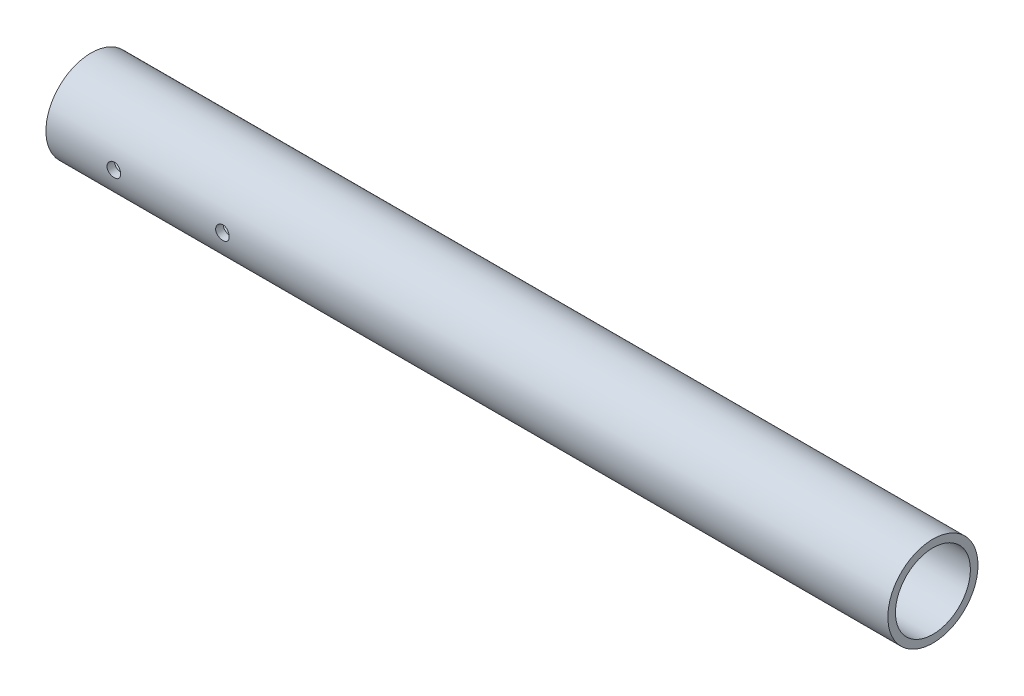
ISO-10303-21;
HEADER;
FILE_DESCRIPTION(('STEP AP214'),'2;1');
FILE_NAME('part.step','',(''),(''),'','','');
FILE_SCHEMA(('AUTOMOTIVE_DESIGN { 1 0 10303 214 1 1 1 1 }'));
ENDSEC;
DATA;
#1=APPLICATION_CONTEXT('core data for automotive mechanical design processes');
#2=APPLICATION_PROTOCOL_DEFINITION('international standard','automotive_design',2000,#1);
#3=PRODUCT_CONTEXT('',#1,'mechanical');
#4=PRODUCT('Part','Part','',(#3));
#5=PRODUCT_RELATED_PRODUCT_CATEGORY('part','',(#4));
#6=PRODUCT_DEFINITION_FORMATION('','',#4);
#7=PRODUCT_DEFINITION_CONTEXT('part definition',#1,'design');
#8=PRODUCT_DEFINITION('design','',#6,#7);
#9=PRODUCT_DEFINITION_SHAPE('','',#8);
#10=(LENGTH_UNIT() NAMED_UNIT(*) SI_UNIT(.MILLI.,.METRE.));
#11=(NAMED_UNIT(*) PLANE_ANGLE_UNIT() SI_UNIT($,.RADIAN.));
#12=(NAMED_UNIT(*) SI_UNIT($,.STERADIAN.) SOLID_ANGLE_UNIT());
#13=UNCERTAINTY_MEASURE_WITH_UNIT(LENGTH_MEASURE(1.E-05),#10,'distance_accuracy_value','');
#14=(GEOMETRIC_REPRESENTATION_CONTEXT(3) GLOBAL_UNCERTAINTY_ASSIGNED_CONTEXT((#13)) GLOBAL_UNIT_ASSIGNED_CONTEXT((#10,
#11,#12)) REPRESENTATION_CONTEXT('',''));
#15=CARTESIAN_POINT('',(0.,0.,0.));
#16=DIRECTION('',(0.,0.,1.));
#17=DIRECTION('',(1.,0.,0.));
#18=AXIS2_PLACEMENT_3D('',#15,#16,#17);
#19=CARTESIAN_POINT('',(-196.85,0.,0.));
#20=DIRECTION('',(1.,0.,0.));
#21=DIRECTION('',(0.,0.,-1.));
#22=AXIS2_PLACEMENT_3D('',#19,#20,#21);
#23=CYLINDRICAL_SURFACE('',#22,21.082);
#24=CARTESIAN_POINT('',(-196.85,0.,0.));
#25=DIRECTION('',(1.,0.,0.));
#26=DIRECTION('',(0.,0.,-1.));
#27=AXIS2_PLACEMENT_3D('',#24,#25,#26);
#28=CIRCLE('',#27,21.082);
#29=CARTESIAN_POINT('',(-196.85,0.,-21.082));
#30=VERTEX_POINT('',#29);
#31=EDGE_CURVE('E10',#30,#30,#28,.T.);
#32=ORIENTED_EDGE('',*,*,#31,.T.);
#33=EDGE_LOOP('',(#32));
#34=FACE_BOUND('',#33,.T.);
#35=CARTESIAN_POINT('',(196.85,0.,0.));
#36=DIRECTION('',(1.,0.,0.));
#37=DIRECTION('',(0.,0.,-1.));
#38=AXIS2_PLACEMENT_3D('',#35,#36,#37);
#39=CIRCLE('',#38,21.082);
#40=CARTESIAN_POINT('',(196.85,0.,-21.082));
#41=VERTEX_POINT('',#40);
#42=EDGE_CURVE('E48',#41,#41,#39,.T.);
#43=ORIENTED_EDGE('',*,*,#42,.F.);
#44=EDGE_LOOP('',(#43));
#45=FACE_BOUND('',#44,.T.);
#46=CARTESIAN_POINT('',(-168.275,0.,21.082));
#47=CARTESIAN_POINT('',(-168.274992696243,0.177265588906064,21.0819971511082));
#48=CARTESIAN_POINT('',(-168.260104327722,0.354633825443566,21.0797407978607));
#49=CARTESIAN_POINT('',(-168.200959639785,0.704412011201187,21.0709569196678));
#50=CARTESIAN_POINT('',(-168.156674780004,0.876816971803984,21.064425243998));
#51=CARTESIAN_POINT('',(-168.040090861165,1.2115560497482,21.0478246855302));
#52=CARTESIAN_POINT('',(-167.967813035828,1.37389769247854,21.0377584843423));
#53=CARTESIAN_POINT('',(-167.797346902468,1.68412370373541,21.0152009969064));
#54=CARTESIAN_POINT('',(-167.69916217104,1.8320100640365,21.0027100454717));
#55=CARTESIAN_POINT('',(-167.478845794194,2.11031643435081,20.9765819826565));
#56=CARTESIAN_POINT('',(-167.3565504399,2.24060616148059,20.9629374218632));
#57=CARTESIAN_POINT('',(-167.091836613573,2.47889671955909,20.9360982303561));
#58=CARTESIAN_POINT('',(-166.949416981135,2.58689626432784,20.9229036256421));
#59=CARTESIAN_POINT('',(-166.647621345587,2.77804840978029,20.8983859912104));
#60=CARTESIAN_POINT('',(-166.488164593206,2.86107486347093,20.8870725883659));
#61=CARTESIAN_POINT('',(-166.157370426842,2.99911783525678,20.8677000439257));
#62=CARTESIAN_POINT('',(-165.986033666236,3.05413589237425,20.8596407235276));
#63=CARTESIAN_POINT('',(-165.637713637157,3.13419550245969,20.8477621012251));
#64=CARTESIAN_POINT('',(-165.460782744137,3.15946016290709,20.8439112577396));
#65=CARTESIAN_POINT('',(-165.105154056933,3.17998699422211,20.8407898425614));
#66=CARTESIAN_POINT('',(-164.926456365603,3.17525090142445,20.8415190057945));
#67=CARTESIAN_POINT('',(-164.573943290049,3.13609297404926,20.8474463775802));
#68=CARTESIAN_POINT('',(-164.40009957517,3.101919701057,20.852607165254));
#69=CARTESIAN_POINT('',(-164.060642024393,3.00524659900985,20.8667578327125));
#70=CARTESIAN_POINT('',(-163.895028423173,2.9427459627244,20.8757478216156));
#71=CARTESIAN_POINT('',(-163.57597641876,2.79093400118089,20.8965852461813));
#72=CARTESIAN_POINT('',(-163.422588837981,2.70151746318002,20.9084438587404));
#73=CARTESIAN_POINT('',(-163.132900855916,2.49848682809598,20.9336742925736));
#74=CARTESIAN_POINT('',(-162.996601585936,2.38487113028626,20.9470462139227));
#75=CARTESIAN_POINT('',(-162.743518756676,2.13530326568608,20.9739618878807));
#76=CARTESIAN_POINT('',(-162.626945855511,1.99913740955179,20.9875060134767));
#77=CARTESIAN_POINT('',(-162.418274544488,1.70906259522473,21.0131148002247));
#78=CARTESIAN_POINT('',(-162.326176243369,1.55515355820367,21.0251794548033));
#79=CARTESIAN_POINT('',(-162.169057340399,1.23377816277263,21.0464826923882));
#80=CARTESIAN_POINT('',(-162.104053073529,1.0663036982249,21.0557195696406));
#81=CARTESIAN_POINT('',(-162.003151041654,0.722645240857121,21.070312259879));
#82=CARTESIAN_POINT('',(-161.967251292923,0.546461842495148,21.0756683373726));
#83=CARTESIAN_POINT('',(-161.925857666781,0.192204765370476,21.0818608911754));
#84=CARTESIAN_POINT('',(-161.920074191204,0.014165649847102,21.0827404122035));
#85=CARTESIAN_POINT('',(-161.938308481612,-0.340339952440584,21.0799979514801));
#86=CARTESIAN_POINT('',(-161.962325317379,-0.516806488119846,21.0763761102388));
#87=CARTESIAN_POINT('',(-162.039237666121,-0.862279899383923,21.0650645063623));
#88=CARTESIAN_POINT('',(-162.091992010307,-1.03131891039135,21.0573946347692));
#89=CARTESIAN_POINT('',(-162.224732948251,-1.35815274399451,21.0388441665934));
#90=CARTESIAN_POINT('',(-162.304720829788,-1.51594703443955,21.0279634181826));
#91=CARTESIAN_POINT('',(-162.490337139215,-1.81708511576191,21.0040933283749));
#92=CARTESIAN_POINT('',(-162.596149173084,-1.9603145348408,20.9910891189132));
#93=CARTESIAN_POINT('',(-162.830154648818,-2.22708618632573,20.9644655933992));
#94=CARTESIAN_POINT('',(-162.958349402479,-2.35062726403488,20.9508462413297));
#95=CARTESIAN_POINT('',(-163.234770906888,-2.57556977848286,20.9243908347895));
#96=CARTESIAN_POINT('',(-163.383156506261,-2.67677703259561,20.9115622997957));
#97=CARTESIAN_POINT('',(-163.694991994603,-2.8528290309045,20.888274456038));
#98=CARTESIAN_POINT('',(-163.858441473836,-2.92767449187153,20.8778150828597));
#99=CARTESIAN_POINT('',(-164.195187201683,-3.04857772519442,20.8605043047131));
#100=CARTESIAN_POINT('',(-164.368446144862,-3.09473749350594,20.8536401303661));
#101=CARTESIAN_POINT('',(-164.720368391081,-3.15728352894343,20.8442630448294));
#102=CARTESIAN_POINT('',(-164.899031316753,-3.17367187018762,20.8417498305174));
#103=CARTESIAN_POINT('',(-165.25475433616,-3.17616021106899,20.8413705974415));
#104=CARTESIAN_POINT('',(-165.431812319645,-3.16256554437416,20.8434577306442));
#105=CARTESIAN_POINT('',(-165.781093207795,-3.10612829026899,20.8519421795031));
#106=CARTESIAN_POINT('',(-165.95331612046,-3.0632857512491,20.8583394880282));
#107=CARTESIAN_POINT('',(-166.287952316415,-2.94967717748468,20.874707044174));
#108=CARTESIAN_POINT('',(-166.450373046203,-2.87893265513936,20.8846745386426));
#109=CARTESIAN_POINT('',(-166.761089428502,-2.71155871536681,20.9070627102117));
#110=CARTESIAN_POINT('',(-166.909384594736,-2.61492840724793,20.9194834717215));
#111=CARTESIAN_POINT('',(-167.189191280687,-2.39741725845486,20.9455292166376));
#112=CARTESIAN_POINT('',(-167.320526091709,-2.27631033164998,20.9591647100844));
#113=CARTESIAN_POINT('',(-167.561117181648,-2.01376149306829,20.9860159394496));
#114=CARTESIAN_POINT('',(-167.670368323069,-1.87231486257536,20.9992315770924));
#115=CARTESIAN_POINT('',(-167.864233030242,-1.57217776718591,21.0238378848768));
#116=CARTESIAN_POINT('',(-167.948706474533,-1.41339594518085,21.0352180180234));
#117=CARTESIAN_POINT('',(-168.089658721969,-1.08380087043068,21.0547677779054));
#118=CARTESIAN_POINT('',(-168.146166480664,-0.913000272113377,21.0629407235248));
#119=CARTESIAN_POINT('',(-168.216783136409,-0.617864332480806,21.0732924950954));
#120=CARTESIAN_POINT('',(-168.238581040015,-0.495349503289414,21.0765410154751));
#121=CARTESIAN_POINT('',(-168.267691941695,-0.248573261637352,21.0808957533839));
#122=CARTESIAN_POINT('',(-168.27500512194,-0.124311871162611,21.0820019978558));
#123=CARTESIAN_POINT('',(-168.275,0.,21.082));
#124=B_SPLINE_CURVE_WITH_KNOTS('',3,(#46,#47,#48,#49,#50,#51,#52,#53,#54,#55,#56,#57,#58,#59,
#60,#61,#62,#63,#64,#65,#66,#67,#68,#69,#70,#71,#72,#73,#74,#75,#76,#77,#78,#79,#80,#81,#82,#83,
#84,#85,#86,#87,#88,#89,#90,#91,#92,#93,#94,#95,#96,#97,#98,#99,#100,#101,#102,#103,#104,#105,
#106,#107,#108,#109,#110,#111,#112,#113,#114,#115,#116,#117,#118,#119,#120,#121,#122,#123),
.UNSPECIFIED.,.T.,.F.,(4,2,2,2,2,2,2,2,2,2,2,2,2,2,2,2,2,2,2,2,2,2,2,2,2,2,2,2,2,2,2,2,2,2,2,2,
2,2,4),(0.,0.53134251242904,1.06320164882559,1.59465813765312,2.12604129424768,2.66116512439553,
3.19631982343619,3.73413403476708,4.27191869076778,4.80564452954643,5.33933947849274,
5.86857170164555,6.39781900700993,6.92916258470443,7.46054132064736,7.99727852314497,
8.53401811031675,9.07108083107701,9.60810694326931,10.1399593459211,10.6717951472021,
11.2010416383702,11.730313159249,12.2634633412738,12.7966447804,13.3342937698578,
13.8719281396386,14.4076397711918,14.9433140793118,15.4735585288678,16.0038021011393,
16.5336376528597,17.0634914377811,17.5984835709691,18.1336000206728,18.6716867332597,
19.2092151415009,19.5818368843675,19.9544539408189),.UNSPECIFIED.);
#125=CARTESIAN_POINT('',(-168.275,0.,21.082));
#126=VERTEX_POINT('',#125);
#127=EDGE_CURVE('E57',#126,#126,#124,.T.);
#128=ORIENTED_EDGE('',*,*,#127,.T.);
#129=EDGE_LOOP('',(#128));
#130=FACE_BOUND('',#129,.T.);
#131=CARTESIAN_POINT('',(-117.475,0.,21.082));
#132=CARTESIAN_POINT('',(-117.474992696243,0.177265588906064,21.0819971511082));
#133=CARTESIAN_POINT('',(-117.460104327722,0.354633825443565,21.0797407978607));
#134=CARTESIAN_POINT('',(-117.400959639785,0.704412011201185,21.0709569196678));
#135=CARTESIAN_POINT('',(-117.356674780004,0.876816971803983,21.064425243998));
#136=CARTESIAN_POINT('',(-117.240090861165,1.21155604974819,21.0478246855302));
#137=CARTESIAN_POINT('',(-117.167813035828,1.37389769247853,21.0377584843423));
#138=CARTESIAN_POINT('',(-116.997346902468,1.68412370373539,21.0152009969064));
#139=CARTESIAN_POINT('',(-116.89916217104,1.83201006403648,21.0027100454717));
#140=CARTESIAN_POINT('',(-116.678845794194,2.1103164343508,20.9765819826565));
#141=CARTESIAN_POINT('',(-116.5565504399,2.24060616148058,20.9629374218632));
#142=CARTESIAN_POINT('',(-116.291836613573,2.47889671955908,20.9360982303561));
#143=CARTESIAN_POINT('',(-116.149416981135,2.58689626432783,20.9229036256421));
#144=CARTESIAN_POINT('',(-115.847621345587,2.77804840978028,20.8983859912104));
#145=CARTESIAN_POINT('',(-115.688164593206,2.86107486347092,20.8870725883659));
#146=CARTESIAN_POINT('',(-115.357370426842,2.99911783525677,20.8677000439257));
#147=CARTESIAN_POINT('',(-115.186033666236,3.05413589237424,20.8596407235276));
#148=CARTESIAN_POINT('',(-114.837713637157,3.13419550245969,20.8477621012251));
#149=CARTESIAN_POINT('',(-114.660782744137,3.15946016290709,20.8439112577396));
#150=CARTESIAN_POINT('',(-114.305154056933,3.17998699422211,20.8407898425614));
#151=CARTESIAN_POINT('',(-114.126456365603,3.17525090142445,20.8415190057945));
#152=CARTESIAN_POINT('',(-113.773943290049,3.13609297404926,20.8474463775802));
#153=CARTESIAN_POINT('',(-113.60009957517,3.101919701057,20.852607165254));
#154=CARTESIAN_POINT('',(-113.260642024393,3.00524659900985,20.8667578327125));
#155=CARTESIAN_POINT('',(-113.095028423174,2.94274596272441,20.8757478216156));
#156=CARTESIAN_POINT('',(-112.77597641876,2.7909340011809,20.8965852461813));
#157=CARTESIAN_POINT('',(-112.622588837981,2.70151746318003,20.9084438587404));
#158=CARTESIAN_POINT('',(-112.332900855916,2.498486828096,20.9336742925736));
#159=CARTESIAN_POINT('',(-112.196601585936,2.38487113028627,20.9470462139227));
#160=CARTESIAN_POINT('',(-111.943518756676,2.1353032656861,20.9739618878806));
#161=CARTESIAN_POINT('',(-111.826945855511,1.99913740955181,20.9875060134767));
#162=CARTESIAN_POINT('',(-111.618274544488,1.70906259522474,21.0131148002247));
#163=CARTESIAN_POINT('',(-111.526176243369,1.55515355820369,21.0251794548033));
#164=CARTESIAN_POINT('',(-111.369057340399,1.23377816277264,21.0464826923882));
#165=CARTESIAN_POINT('',(-111.304053073529,1.06630369822491,21.0557195696406));
#166=CARTESIAN_POINT('',(-111.203151041654,0.722645240857131,21.070312259879));
#167=CARTESIAN_POINT('',(-111.167251292923,0.546461842495156,21.0756683373726));
#168=CARTESIAN_POINT('',(-111.125857666781,0.192204765370483,21.0818608911754));
#169=CARTESIAN_POINT('',(-111.120074191204,0.0141656498471105,21.0827404122035));
#170=CARTESIAN_POINT('',(-111.138308481612,-0.340339952440575,21.0799979514801));
#171=CARTESIAN_POINT('',(-111.162325317379,-0.516806488119837,21.0763761102388));
#172=CARTESIAN_POINT('',(-111.239237666121,-0.86227989938391,21.0650645063623));
#173=CARTESIAN_POINT('',(-111.291992010307,-1.03131891039133,21.0573946347692));
#174=CARTESIAN_POINT('',(-111.424732948251,-1.35815274399449,21.0388441665934));
#175=CARTESIAN_POINT('',(-111.504720829788,-1.51594703443953,21.0279634181826));
#176=CARTESIAN_POINT('',(-111.690337139215,-1.81708511576191,21.0040933283749));
#177=CARTESIAN_POINT('',(-111.796149173084,-1.9603145348408,20.9910891189132));
#178=CARTESIAN_POINT('',(-112.030154648818,-2.22708618632573,20.9644655933992));
#179=CARTESIAN_POINT('',(-112.158349402479,-2.35062726403487,20.9508462413297));
#180=CARTESIAN_POINT('',(-112.434770906888,-2.57556977848285,20.9243908347895));
#181=CARTESIAN_POINT('',(-112.583156506261,-2.67677703259561,20.9115622997957));
#182=CARTESIAN_POINT('',(-112.894991994603,-2.85282903090451,20.888274456038));
#183=CARTESIAN_POINT('',(-113.058441473836,-2.92767449187153,20.8778150828597));
#184=CARTESIAN_POINT('',(-113.395187201683,-3.04857772519442,20.8605043047131));
#185=CARTESIAN_POINT('',(-113.568446144862,-3.09473749350594,20.8536401303661));
#186=CARTESIAN_POINT('',(-113.920368391081,-3.15728352894343,20.8442630448294));
#187=CARTESIAN_POINT('',(-114.099031316753,-3.17367187018762,20.8417498305174));
#188=CARTESIAN_POINT('',(-114.45475433616,-3.17616021106898,20.8413705974415));
#189=CARTESIAN_POINT('',(-114.631812319645,-3.16256554437416,20.8434577306442));
#190=CARTESIAN_POINT('',(-114.981093207795,-3.10612829026899,20.8519421795031));
#191=CARTESIAN_POINT('',(-115.15331612046,-3.0632857512491,20.8583394880282));
#192=CARTESIAN_POINT('',(-115.487952316415,-2.94967717748468,20.874707044174));
#193=CARTESIAN_POINT('',(-115.650373046203,-2.87893265513936,20.8846745386426));
#194=CARTESIAN_POINT('',(-115.961089428502,-2.71155871536682,20.9070627102117));
#195=CARTESIAN_POINT('',(-116.109384594736,-2.61492840724794,20.9194834717215));
#196=CARTESIAN_POINT('',(-116.389191280687,-2.39741725845485,20.9455292166376));
#197=CARTESIAN_POINT('',(-116.520526091709,-2.27631033164997,20.9591647100844));
#198=CARTESIAN_POINT('',(-116.761117181648,-2.01376149306828,20.9860159394496));
#199=CARTESIAN_POINT('',(-116.870368323069,-1.87231486257537,20.9992315770924));
#200=CARTESIAN_POINT('',(-117.064233030242,-1.57217776718592,21.0238378848768));
#201=CARTESIAN_POINT('',(-117.148706474533,-1.41339594518085,21.0352180180234));
#202=CARTESIAN_POINT('',(-117.289658721969,-1.08380087043068,21.0547677779054));
#203=CARTESIAN_POINT('',(-117.346166480664,-0.913000272113387,21.0629407235248));
#204=CARTESIAN_POINT('',(-117.416783136409,-0.617864332480819,21.0732924950954));
#205=CARTESIAN_POINT('',(-117.438581040015,-0.495349503289426,21.0765410154751));
#206=CARTESIAN_POINT('',(-117.467691941695,-0.248573261637358,21.0808957533839));
#207=CARTESIAN_POINT('',(-117.47500512194,-0.124311871162614,21.0820019978558));
#208=CARTESIAN_POINT('',(-117.475,0.,21.082));
#209=B_SPLINE_CURVE_WITH_KNOTS('',3,(#131,#132,#133,#134,#135,#136,#137,#138,#139,#140,#141,
#142,#143,#144,#145,#146,#147,#148,#149,#150,#151,#152,#153,#154,#155,#156,#157,#158,#159,#160,
#161,#162,#163,#164,#165,#166,#167,#168,#169,#170,#171,#172,#173,#174,#175,#176,#177,#178,#179,
#180,#181,#182,#183,#184,#185,#186,#187,#188,#189,#190,#191,#192,#193,#194,#195,#196,#197,#198,
#199,#200,#201,#202,#203,#204,#205,#206,#207,#208),.UNSPECIFIED.,.T.,.F.,(4,2,2,2,2,2,2,2,2,2,2,
2,2,2,2,2,2,2,2,2,2,2,2,2,2,2,2,2,2,2,2,2,2,2,2,2,2,2,4),(0.,0.531342512429038,1.06320164882558,
1.5946581376531,2.12604129424767,2.66116512439551,3.19631982343617,3.73413403476706,
4.27191869076775,4.80564452954642,5.33933947849273,5.86857170164552,6.39781900700991,
6.92916258470442,7.46054132064733,7.99727852314494,8.53401811031673,9.07108083107699,
9.6081069432693,10.1399593459211,10.6717951472021,11.2010416383702,11.730313159249,
12.2634633412738,12.7966447804,13.3342937698578,13.8719281396386,14.4076397711918,
14.9433140793118,15.4735585288678,16.0038021011393,16.5336376528597,17.0634914377811,
17.5984835709691,18.1336000206727,18.6716867332597,19.2092151415009,19.5818368843675,
19.9544539408189),.UNSPECIFIED.);
#210=CARTESIAN_POINT('',(-117.475,0.,21.082));
#211=VERTEX_POINT('',#210);
#212=EDGE_CURVE('E75',#211,#211,#209,.T.);
#213=ORIENTED_EDGE('',*,*,#212,.T.);
#214=EDGE_LOOP('',(#213));
#215=FACE_BOUND('',#214,.T.);
#216=ADVANCED_FACE('F30',(#34,#45,#130,#215),#23,.T.);
#217=CARTESIAN_POINT('',(-196.85,0.,0.));
#218=DIRECTION('',(1.,0.,0.));
#219=DIRECTION('',(0.,0.,-1.));
#220=AXIS2_PLACEMENT_3D('',#217,#218,#219);
#221=CYLINDRICAL_SURFACE('',#220,17.526);
#222=CARTESIAN_POINT('',(-196.85,0.,0.));
#223=DIRECTION('',(1.,0.,0.));
#224=DIRECTION('',(0.,0.,-1.));
#225=AXIS2_PLACEMENT_3D('',#222,#223,#224);
#226=CIRCLE('',#225,17.526);
#227=CARTESIAN_POINT('',(-196.85,0.,-17.526));
#228=VERTEX_POINT('',#227);
#229=EDGE_CURVE('E43',#228,#228,#226,.T.);
#230=ORIENTED_EDGE('',*,*,#229,.F.);
#231=EDGE_LOOP('',(#230));
#232=FACE_BOUND('',#231,.T.);
#233=CARTESIAN_POINT('',(196.85,0.,0.));
#234=DIRECTION('',(1.,0.,0.));
#235=DIRECTION('',(0.,0.,-1.));
#236=AXIS2_PLACEMENT_3D('',#233,#234,#235);
#237=CIRCLE('',#236,17.526);
#238=CARTESIAN_POINT('',(196.85,0.,-17.526));
#239=VERTEX_POINT('',#238);
#240=EDGE_CURVE('E81',#239,#239,#237,.T.);
#241=ORIENTED_EDGE('',*,*,#240,.T.);
#242=EDGE_LOOP('',(#241));
#243=FACE_BOUND('',#242,.T.);
#244=CARTESIAN_POINT('',(-168.275,0.,17.526));
#245=CARTESIAN_POINT('',(-168.274993132514,0.176790823508008,17.5259968412274));
#246=CARTESIAN_POINT('',(-168.26018396573,0.353672270747985,17.5232972774411));
#247=CARTESIAN_POINT('',(-168.201372438004,0.702458155041367,17.5127883009458));
#248=CARTESIAN_POINT('',(-168.157344740396,0.874358137310074,17.5049744534986));
#249=CARTESIAN_POINT('',(-168.041482418544,1.20808580036968,17.485111731742));
#250=CARTESIAN_POINT('',(-167.96967216344,1.3699221643449,17.4730665697294));
#251=CARTESIAN_POINT('',(-167.800350679922,1.67923272236703,17.4460593997375));
#252=CARTESIAN_POINT('',(-167.702841801324,1.82670822784651,17.4310976584752));
#253=CARTESIAN_POINT('',(-167.483729501993,2.10478127681953,17.3997234174553));
#254=CARTESIAN_POINT('',(-167.361893953305,2.23519445696565,17.3832978577657));
#255=CARTESIAN_POINT('',(-167.098086238519,2.47384671567765,17.3509451203049));
#256=CARTESIAN_POINT('',(-166.956112684689,2.58208426483874,17.3350179769725));
#257=CARTESIAN_POINT('',(-166.65476755925,2.77407084888638,17.3053386524232));
#258=CARTESIAN_POINT('',(-166.49527574471,2.8576339824516,17.2916033234658));
#259=CARTESIAN_POINT('',(-166.164227502684,2.9967100266702,17.2680459841376));
#260=CARTESIAN_POINT('',(-165.992672044777,3.05222518866685,17.2582236596927));
#261=CARTESIAN_POINT('',(-165.644333420596,3.13304110203761,17.2437354838221));
#262=CARTESIAN_POINT('',(-165.467626937035,3.15866238598857,17.2390149702052));
#263=CARTESIAN_POINT('',(-165.112365006253,3.17995782064228,17.235099927382));
#264=CARTESIAN_POINT('',(-164.933809714956,3.1756344765814,17.2359049358977));
#265=CARTESIAN_POINT('',(-164.582230051004,3.13742365897766,17.2429001682717));
#266=CARTESIAN_POINT('',(-164.409164708668,3.10389926153133,17.2490242538492));
#267=CARTESIAN_POINT('',(-164.071156214092,3.00880912932248,17.2658638407267));
#268=CARTESIAN_POINT('',(-163.906213386391,2.94724227511611,17.2765795253205));
#269=CARTESIAN_POINT('',(-163.588061936362,2.79745571266685,17.3014647929721));
#270=CARTESIAN_POINT('',(-163.434924507933,2.70908808725447,17.3156534578234));
#271=CARTESIAN_POINT('',(-163.145514150003,2.50831315208049,17.3458731721502));
#272=CARTESIAN_POINT('',(-163.009242823655,2.39590355985283,17.3619043964854));
#273=CARTESIAN_POINT('',(-162.755333896299,2.14827149301382,17.3942918762038));
#274=CARTESIAN_POINT('',(-162.637999429291,2.01273815664841,17.4106494468318));
#275=CARTESIAN_POINT('',(-162.427688621113,1.72374960651158,17.4416297211863));
#276=CARTESIAN_POINT('',(-162.334712494357,1.57029423499867,17.4562524096409));
#277=CARTESIAN_POINT('',(-162.175718396598,1.24951132270804,17.4821419521182));
#278=CARTESIAN_POINT('',(-162.109730448668,1.08216858038396,17.4934050650234));
#279=CARTESIAN_POINT('',(-162.006884348364,0.738524824278301,17.5112771866033));
#280=CARTESIAN_POINT('',(-161.970023310367,0.562224699752729,17.5178866563105));
#281=CARTESIAN_POINT('',(-161.926895827197,0.208280155645559,17.5256438790602));
#282=CARTESIAN_POINT('',(-161.920213792981,0.0306879466818512,17.5268658171028));
#283=CARTESIAN_POINT('',(-161.936521371192,-0.323076767936706,17.5239146703191));
#284=CARTESIAN_POINT('',(-161.959509626478,-0.499249338156011,17.5197418322538));
#285=CARTESIAN_POINT('',(-162.034159642385,-0.843866600411561,17.5065161011469));
#286=CARTESIAN_POINT('',(-162.085612547972,-1.01235801735562,17.4974987676082));
#287=CARTESIAN_POINT('',(-162.215506359517,-1.3383231301214,17.4755909179164));
#288=CARTESIAN_POINT('',(-162.293949001188,-1.49579611656222,17.4627001526692));
#289=CARTESIAN_POINT('',(-162.476525502701,-1.79703794282551,17.4342904171948));
#290=CARTESIAN_POINT('',(-162.580915097512,-1.94064931955918,17.4187457992515));
#291=CARTESIAN_POINT('',(-162.812074418528,-2.20846506883692,17.3868220571775));
#292=CARTESIAN_POINT('',(-162.938846086358,-2.33266775593063,17.3704428607355));
#293=CARTESIAN_POINT('',(-163.213047053409,-2.55970748627499,17.3384518393717));
#294=CARTESIAN_POINT('',(-163.360712095506,-2.66226178053652,17.3228519867864));
#295=CARTESIAN_POINT('',(-163.671417833441,-2.84110984177048,17.2944212278246));
#296=CARTESIAN_POINT('',(-163.834457982026,-2.91740454296297,17.2815902229488));
#297=CARTESIAN_POINT('',(-164.170545034343,-3.04115979533501,17.2602426012819));
#298=CARTESIAN_POINT('',(-164.34354160251,-3.08875345587471,17.2517060985603));
#299=CARTESIAN_POINT('',(-164.695243732187,-3.1541689769781,17.2398671271274));
#300=CARTESIAN_POINT('',(-164.873948695075,-3.17199394891528,17.2365641114227));
#301=CARTESIAN_POINT('',(-165.229165541857,-3.17726742876193,17.2355925385196));
#302=CARTESIAN_POINT('',(-165.405670738435,-3.16516161695717,17.2378413124165));
#303=CARTESIAN_POINT('',(-165.754086632076,-3.11188910689162,17.2475373034534));
#304=CARTESIAN_POINT('',(-165.925997352356,-3.07072255551699,17.2549844943182));
#305=CARTESIAN_POINT('',(-166.260125897203,-2.96067981082376,17.2742044563146));
#306=CARTESIAN_POINT('',(-166.422359022944,-2.8918487670874,17.2859701767276));
#307=CARTESIAN_POINT('',(-166.733046204286,-2.72847862049298,17.3125070165183));
#308=CARTESIAN_POINT('',(-166.88149937582,-2.63393786972799,17.3272783285293));
#309=CARTESIAN_POINT('',(-167.162651300551,-2.42026944589852,17.3584203635157));
#310=CARTESIAN_POINT('',(-167.295100559389,-2.30081626698694,17.37481057328));
#311=CARTESIAN_POINT('',(-167.53822420719,-2.04139533634302,17.4071948659678));
#312=CARTESIAN_POINT('',(-167.648893583025,-1.90142287454243,17.4231888569539));
#313=CARTESIAN_POINT('',(-167.846171023297,-1.60354404533996,17.4531342301883));
#314=CARTESIAN_POINT('',(-167.932571193469,-1.44549813095463,17.4670675069251));
#315=CARTESIAN_POINT('',(-168.077456942508,-1.11693687333545,17.4911451342375));
#316=CARTESIAN_POINT('',(-168.135969245347,-0.946433648982024,17.5012931100993));
#317=CARTESIAN_POINT('',(-168.211276479759,-0.646146664812287,17.5145413811557));
#318=CARTESIAN_POINT('',(-168.235132786512,-0.518138865968793,17.5188145120769));
#319=CARTESIAN_POINT('',(-168.266996893811,-0.260103700609919,17.5245449517082));
#320=CARTESIAN_POINT('',(-168.275005052851,-0.130076379844322,17.5260023241122));
#321=CARTESIAN_POINT('',(-168.275,0.,17.526));
#322=B_SPLINE_CURVE_WITH_KNOTS('',3,(#244,#245,#246,#247,#248,#249,#250,#251,#252,#253,#254,
#255,#256,#257,#258,#259,#260,#261,#262,#263,#264,#265,#266,#267,#268,#269,#270,#271,#272,#273,
#274,#275,#276,#277,#278,#279,#280,#281,#282,#283,#284,#285,#286,#287,#288,#289,#290,#291,#292,
#293,#294,#295,#296,#297,#298,#299,#300,#301,#302,#303,#304,#305,#306,#307,#308,#309,#310,#311,
#312,#313,#314,#315,#316,#317,#318,#319,#320,#321),.UNSPECIFIED.,.T.,.F.,(4,2,2,2,2,2,2,2,2,2,2,
2,2,2,2,2,2,2,2,2,2,2,2,2,2,2,2,2,2,2,2,2,2,2,2,2,2,2,4),(0.,0.52989684739867,1.06025379298762,
1.59014659312776,2.11999095802633,2.65515610450925,3.19035814774706,3.72949522868479,
4.26858902750703,4.80184775131234,5.33506186200683,5.86173930617049,6.3884377769336,
6.91809776769754,7.44780806499452,7.985299753981,8.52279617407827,9.06088891772035,
9.59892834547639,10.1295354893394,10.6601183636946,11.1868588327276,11.713633182854,
12.2458209999473,12.778055006572,13.3168607871052,13.8556473969223,14.3919156166158,
14.9281277829441,15.4564037756751,15.9846770982785,16.5120917356115,17.0395401864443,
17.5743685624972,18.1093198977252,18.648722923454,19.1876080135939,19.5774960261897,
19.9673752191978),.UNSPECIFIED.);
#323=CARTESIAN_POINT('',(-168.275,0.,17.526));
#324=VERTEX_POINT('',#323);
#325=EDGE_CURVE('E51',#324,#324,#322,.T.);
#326=ORIENTED_EDGE('',*,*,#325,.F.);
#327=EDGE_LOOP('',(#326));
#328=FACE_BOUND('',#327,.T.);
#329=CARTESIAN_POINT('',(-117.475,0.,17.526));
#330=CARTESIAN_POINT('',(-117.474993132514,0.176790823508009,17.5259968412274));
#331=CARTESIAN_POINT('',(-117.46018396573,0.353672270747986,17.5232972774411));
#332=CARTESIAN_POINT('',(-117.401372438004,0.702458155041366,17.5127883009458));
#333=CARTESIAN_POINT('',(-117.357344740396,0.874358137310071,17.5049744534986));
#334=CARTESIAN_POINT('',(-117.241482418544,1.20808580036967,17.485111731742));
#335=CARTESIAN_POINT('',(-117.16967216344,1.36992216434489,17.4730665697294));
#336=CARTESIAN_POINT('',(-117.000350679922,1.67923272236702,17.4460593997375));
#337=CARTESIAN_POINT('',(-116.902841801324,1.82670822784651,17.4310976584752));
#338=CARTESIAN_POINT('',(-116.683729501993,2.10478127681952,17.3997234174553));
#339=CARTESIAN_POINT('',(-116.561893953305,2.23519445696564,17.3832978577657));
#340=CARTESIAN_POINT('',(-116.298086238519,2.47384671567764,17.3509451203049));
#341=CARTESIAN_POINT('',(-116.156112684689,2.58208426483874,17.3350179769725));
#342=CARTESIAN_POINT('',(-115.85476755925,2.77407084888638,17.3053386524232));
#343=CARTESIAN_POINT('',(-115.69527574471,2.85763398245159,17.2916033234658));
#344=CARTESIAN_POINT('',(-115.364227502684,2.9967100266702,17.2680459841376));
#345=CARTESIAN_POINT('',(-115.192672044777,3.05222518866685,17.2582236596927));
#346=CARTESIAN_POINT('',(-114.844333420596,3.13304110203761,17.2437354838221));
#347=CARTESIAN_POINT('',(-114.667626937035,3.15866238598856,17.2390149702052));
#348=CARTESIAN_POINT('',(-114.312365006253,3.17995782064228,17.235099927382));
#349=CARTESIAN_POINT('',(-114.133809714956,3.1756344765814,17.2359049358977));
#350=CARTESIAN_POINT('',(-113.782230051004,3.13742365897766,17.2429001682717));
#351=CARTESIAN_POINT('',(-113.609164708668,3.10389926153133,17.2490242538492));
#352=CARTESIAN_POINT('',(-113.271156214092,3.00880912932249,17.2658638407267));
#353=CARTESIAN_POINT('',(-113.106213386391,2.94724227511612,17.2765795253205));
#354=CARTESIAN_POINT('',(-112.788061936362,2.79745571266688,17.3014647929721));
#355=CARTESIAN_POINT('',(-112.634924507933,2.7090880872545,17.3156534578234));
#356=CARTESIAN_POINT('',(-112.345514150003,2.50831315208051,17.3458731721502));
#357=CARTESIAN_POINT('',(-112.209242823655,2.39590355985285,17.3619043964854));
#358=CARTESIAN_POINT('',(-111.955333896299,2.14827149301383,17.3942918762038));
#359=CARTESIAN_POINT('',(-111.837999429291,2.01273815664842,17.4106494468318));
#360=CARTESIAN_POINT('',(-111.627688621113,1.72374960651159,17.4416297211863));
#361=CARTESIAN_POINT('',(-111.534712494357,1.57029423499867,17.4562524096409));
#362=CARTESIAN_POINT('',(-111.375718396598,1.24951132270804,17.4821419521182));
#363=CARTESIAN_POINT('',(-111.309730448668,1.08216858038397,17.4934050650234));
#364=CARTESIAN_POINT('',(-111.206884348364,0.73852482427832,17.5112771866033));
#365=CARTESIAN_POINT('',(-111.170023310367,0.562224699752747,17.5178866563105));
#366=CARTESIAN_POINT('',(-111.126895827197,0.208280155645574,17.5256438790602));
#367=CARTESIAN_POINT('',(-111.120213792981,0.0306879466818639,17.5268658171028));
#368=CARTESIAN_POINT('',(-111.136521371192,-0.323076767936695,17.5239146703191));
#369=CARTESIAN_POINT('',(-111.159509626478,-0.499249338156001,17.5197418322538));
#370=CARTESIAN_POINT('',(-111.234159642385,-0.843866600411554,17.5065161011469));
#371=CARTESIAN_POINT('',(-111.285612547972,-1.01235801735561,17.4974987676082));
#372=CARTESIAN_POINT('',(-111.415506359517,-1.33832313012139,17.4755909179164));
#373=CARTESIAN_POINT('',(-111.493949001188,-1.49579611656221,17.4627001526692));
#374=CARTESIAN_POINT('',(-111.676525502701,-1.7970379428255,17.4342904171948));
#375=CARTESIAN_POINT('',(-111.780915097512,-1.94064931955918,17.4187457992515));
#376=CARTESIAN_POINT('',(-112.012074418528,-2.20846506883692,17.3868220571775));
#377=CARTESIAN_POINT('',(-112.138846086358,-2.33266775593063,17.3704428607355));
#378=CARTESIAN_POINT('',(-112.413047053409,-2.55970748627499,17.3384518393717));
#379=CARTESIAN_POINT('',(-112.560712095506,-2.66226178053652,17.3228519867864));
#380=CARTESIAN_POINT('',(-112.871417833441,-2.84110984177048,17.2944212278246));
#381=CARTESIAN_POINT('',(-113.034457982026,-2.91740454296296,17.2815902229488));
#382=CARTESIAN_POINT('',(-113.370545034343,-3.04115979533501,17.2602426012819));
#383=CARTESIAN_POINT('',(-113.54354160251,-3.08875345587471,17.2517060985603));
#384=CARTESIAN_POINT('',(-113.895243732187,-3.15416897697809,17.2398671271274));
#385=CARTESIAN_POINT('',(-114.073948695075,-3.17199394891527,17.2365641114227));
#386=CARTESIAN_POINT('',(-114.429165541857,-3.17726742876193,17.2355925385196));
#387=CARTESIAN_POINT('',(-114.605670738435,-3.16516161695717,17.2378413124165));
#388=CARTESIAN_POINT('',(-114.954086632076,-3.11188910689162,17.2475373034534));
#389=CARTESIAN_POINT('',(-115.125997352356,-3.07072255551699,17.2549844943182));
#390=CARTESIAN_POINT('',(-115.460125897203,-2.96067981082377,17.2742044563146));
#391=CARTESIAN_POINT('',(-115.622359022944,-2.89184876708741,17.2859701767276));
#392=CARTESIAN_POINT('',(-115.933046204286,-2.72847862049299,17.3125070165183));
#393=CARTESIAN_POINT('',(-116.08149937582,-2.633937869728,17.3272783285292));
#394=CARTESIAN_POINT('',(-116.362651300551,-2.42026944589855,17.3584203635157));
#395=CARTESIAN_POINT('',(-116.495100559389,-2.30081626698697,17.37481057328));
#396=CARTESIAN_POINT('',(-116.73822420719,-2.04139533634304,17.4071948659678));
#397=CARTESIAN_POINT('',(-116.848893583025,-1.90142287454245,17.4231888569539));
#398=CARTESIAN_POINT('',(-117.046171023297,-1.60354404533997,17.4531342301883));
#399=CARTESIAN_POINT('',(-117.132571193469,-1.44549813095465,17.4670675069251));
#400=CARTESIAN_POINT('',(-117.277456942508,-1.11693687333548,17.4911451342375));
#401=CARTESIAN_POINT('',(-117.335969245347,-0.946433648982046,17.5012931100993));
#402=CARTESIAN_POINT('',(-117.411276479759,-0.646146664812306,17.5145413811557));
#403=CARTESIAN_POINT('',(-117.435132786512,-0.518138865968811,17.5188145120769));
#404=CARTESIAN_POINT('',(-117.466996893811,-0.26010370060993,17.5245449517082));
#405=CARTESIAN_POINT('',(-117.475005052851,-0.130076379844328,17.5260023241122));
#406=CARTESIAN_POINT('',(-117.475,0.,17.526));
#407=B_SPLINE_CURVE_WITH_KNOTS('',3,(#329,#330,#331,#332,#333,#334,#335,#336,#337,#338,#339,
#340,#341,#342,#343,#344,#345,#346,#347,#348,#349,#350,#351,#352,#353,#354,#355,#356,#357,#358,
#359,#360,#361,#362,#363,#364,#365,#366,#367,#368,#369,#370,#371,#372,#373,#374,#375,#376,#377,
#378,#379,#380,#381,#382,#383,#384,#385,#386,#387,#388,#389,#390,#391,#392,#393,#394,#395,#396,
#397,#398,#399,#400,#401,#402,#403,#404,#405,#406),.UNSPECIFIED.,.T.,.F.,(4,2,2,2,2,2,2,2,2,2,2,
2,2,2,2,2,2,2,2,2,2,2,2,2,2,2,2,2,2,2,2,2,2,2,2,2,2,2,4),(0.,0.529896847398668,1.06025379298761,
1.59014659312776,2.11999095802632,2.65515610450925,3.19035814774705,3.72949522868479,
4.26858902750701,4.80184775131233,5.33506186200683,5.86173930617045,6.38843777693352,
6.91809776769748,7.4478080649945,7.98529975398098,8.52279617407827,9.06088891772032,
9.59892834547637,10.1295354893394,10.6601183636945,11.1868588327276,11.713633182854,
12.2458209999474,12.778055006572,13.3168607871052,13.8556473969222,14.3919156166157,
14.9281277829441,15.4564037756751,15.9846770982784,16.5120917356115,17.0395401864443,
17.5743685624972,18.1093198977251,18.6487229234539,19.1876080135939,19.5774960261897,
19.9673752191978),.UNSPECIFIED.);
#408=CARTESIAN_POINT('',(-117.475,0.,17.526));
#409=VERTEX_POINT('',#408);
#410=EDGE_CURVE('E34',#409,#409,#407,.T.);
#411=ORIENTED_EDGE('',*,*,#410,.F.);
#412=EDGE_LOOP('',(#411));
#413=FACE_BOUND('',#412,.T.);
#414=ADVANCED_FACE('F58',(#232,#243,#328,#413),#221,.F.);
#415=CARTESIAN_POINT('',(-196.85,0.,0.));
#416=DIRECTION('',(1.,0.,0.));
#417=DIRECTION('',(0.,0.,-1.));
#418=AXIS2_PLACEMENT_3D('',#415,#416,#417);
#419=PLANE('',#418);
#420=ORIENTED_EDGE('',*,*,#229,.T.);
#421=EDGE_LOOP('',(#420));
#422=FACE_BOUND('',#421,.T.);
#423=ORIENTED_EDGE('',*,*,#31,.F.);
#424=EDGE_LOOP('',(#423));
#425=FACE_BOUND('',#424,.T.);
#426=ADVANCED_FACE('F100',(#422,#425),#419,.F.);
#427=CARTESIAN_POINT('',(196.85,0.,0.));
#428=DIRECTION('',(1.,0.,0.));
#429=DIRECTION('',(0.,0.,-1.));
#430=AXIS2_PLACEMENT_3D('',#427,#428,#429);
#431=PLANE('',#430);
#432=ORIENTED_EDGE('',*,*,#42,.T.);
#433=EDGE_LOOP('',(#432));
#434=FACE_BOUND('',#433,.T.);
#435=ORIENTED_EDGE('',*,*,#240,.F.);
#436=EDGE_LOOP('',(#435));
#437=FACE_BOUND('',#436,.T.);
#438=ADVANCED_FACE('F65',(#434,#437),#431,.T.);
#439=CARTESIAN_POINT('',(-165.1,0.,21.082));
#440=DIRECTION('',(0.,0.,-1.));
#441=DIRECTION('',(-1.,0.,0.));
#442=AXIS2_PLACEMENT_3D('',#439,#440,#441);
#443=CYLINDRICAL_SURFACE('',#442,3.17500000000009);
#444=ORIENTED_EDGE('',*,*,#127,.F.);
#445=EDGE_LOOP('',(#444));
#446=FACE_BOUND('',#445,.T.);
#447=ORIENTED_EDGE('',*,*,#325,.T.);
#448=EDGE_LOOP('',(#447));
#449=FACE_BOUND('',#448,.T.);
#450=ADVANCED_FACE('F61',(#446,#449),#443,.F.);
#451=CARTESIAN_POINT('',(-114.3,0.,21.082));
#452=DIRECTION('',(0.,0.,-1.));
#453=DIRECTION('',(-1.,0.,0.));
#454=AXIS2_PLACEMENT_3D('',#451,#452,#453);
#455=CYLINDRICAL_SURFACE('',#454,3.17500000000008);
#456=ORIENTED_EDGE('',*,*,#212,.F.);
#457=EDGE_LOOP('',(#456));
#458=FACE_BOUND('',#457,.T.);
#459=ORIENTED_EDGE('',*,*,#410,.T.);
#460=EDGE_LOOP('',(#459));
#461=FACE_BOUND('',#460,.T.);
#462=ADVANCED_FACE('F64',(#458,#461),#455,.F.);
#463=CLOSED_SHELL('',(#216,#414,#426,#438,#450,#462));
#464=MANIFOLD_SOLID_BREP('B2',#463);
#465=ADVANCED_BREP_SHAPE_REPRESENTATION('',(#18,#464),#14);
#466=SHAPE_DEFINITION_REPRESENTATION(#9,#465);
ENDSEC;
END-ISO-10303-21;
